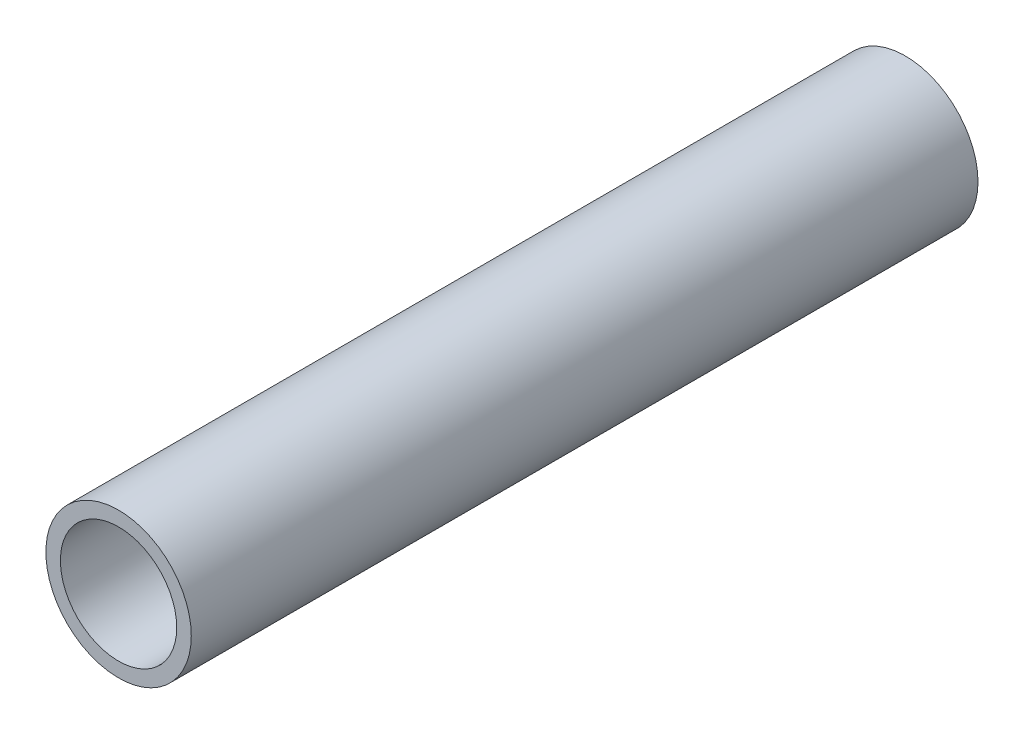
ISO-10303-21;
HEADER;
FILE_DESCRIPTION(('STEP AP214'),'2;1');
FILE_NAME('part.step','',(''),(''),'','','');
FILE_SCHEMA(('AUTOMOTIVE_DESIGN { 1 0 10303 214 1 1 1 1 }'));
ENDSEC;
DATA;
#1=APPLICATION_CONTEXT('core data for automotive mechanical design processes');
#2=APPLICATION_PROTOCOL_DEFINITION('international standard','automotive_design',2000,#1);
#3=PRODUCT_CONTEXT('',#1,'mechanical');
#4=PRODUCT('Part','Part','',(#3));
#5=PRODUCT_RELATED_PRODUCT_CATEGORY('part','',(#4));
#6=PRODUCT_DEFINITION_FORMATION('','',#4);
#7=PRODUCT_DEFINITION_CONTEXT('part definition',#1,'design');
#8=PRODUCT_DEFINITION('design','',#6,#7);
#9=PRODUCT_DEFINITION_SHAPE('','',#8);
#10=(LENGTH_UNIT() NAMED_UNIT(*) SI_UNIT(.MILLI.,.METRE.));
#11=(NAMED_UNIT(*) PLANE_ANGLE_UNIT() SI_UNIT($,.RADIAN.));
#12=(NAMED_UNIT(*) SI_UNIT($,.STERADIAN.) SOLID_ANGLE_UNIT());
#13=UNCERTAINTY_MEASURE_WITH_UNIT(LENGTH_MEASURE(1.E-05),#10,'distance_accuracy_value','');
#14=(GEOMETRIC_REPRESENTATION_CONTEXT(3) GLOBAL_UNCERTAINTY_ASSIGNED_CONTEXT((#13)) GLOBAL_UNIT_ASSIGNED_CONTEXT((#10,
#11,#12)) REPRESENTATION_CONTEXT('',''));
#15=CARTESIAN_POINT('',(0.,0.,0.));
#16=DIRECTION('',(0.,0.,1.));
#17=DIRECTION('',(1.,0.,0.));
#18=AXIS2_PLACEMENT_3D('',#15,#16,#17);
#19=CARTESIAN_POINT('',(0.,0.,13.525));
#20=DIRECTION('',(0.,0.,1.));
#21=DIRECTION('',(1.,0.,0.));
#22=AXIS2_PLACEMENT_3D('',#19,#20,#21);
#23=PLANE('',#22);
#24=CARTESIAN_POINT('',(0.,0.,13.525));
#25=DIRECTION('',(0.,0.,1.));
#26=DIRECTION('',(1.,0.,0.));
#27=AXIS2_PLACEMENT_3D('',#24,#25,#26);
#28=CIRCLE('',#27,1.25);
#29=CARTESIAN_POINT('',(1.25,0.,13.525));
#30=VERTEX_POINT('',#29);
#31=EDGE_CURVE('E10',#30,#30,#28,.T.);
#32=ORIENTED_EDGE('',*,*,#31,.T.);
#33=EDGE_LOOP('',(#32));
#34=FACE_BOUND('',#33,.T.);
#35=CARTESIAN_POINT('',(0.,0.,13.525));
#36=DIRECTION('',(0.,0.,1.));
#37=DIRECTION('',(1.,0.,0.));
#38=AXIS2_PLACEMENT_3D('',#35,#36,#37);
#39=CIRCLE('',#38,1.);
#40=CARTESIAN_POINT('',(1.,0.,13.525));
#41=VERTEX_POINT('',#40);
#42=EDGE_CURVE('E41',#41,#41,#39,.T.);
#43=ORIENTED_EDGE('',*,*,#42,.F.);
#44=EDGE_LOOP('',(#43));
#45=FACE_BOUND('',#44,.T.);
#46=ADVANCED_FACE('F30',(#34,#45),#23,.T.);
#47=CARTESIAN_POINT('',(0.,0.,0.));
#48=DIRECTION('',(0.,0.,1.));
#49=DIRECTION('',(1.,0.,0.));
#50=AXIS2_PLACEMENT_3D('',#47,#48,#49);
#51=PLANE('',#50);
#52=CARTESIAN_POINT('',(0.,0.,0.));
#53=DIRECTION('',(0.,0.,1.));
#54=DIRECTION('',(1.,0.,0.));
#55=AXIS2_PLACEMENT_3D('',#52,#53,#54);
#56=CIRCLE('',#55,1.25);
#57=CARTESIAN_POINT('',(1.25,0.,0.));
#58=VERTEX_POINT('',#57);
#59=EDGE_CURVE('E34',#58,#58,#56,.T.);
#60=ORIENTED_EDGE('',*,*,#59,.F.);
#61=EDGE_LOOP('',(#60));
#62=FACE_BOUND('',#61,.T.);
#63=CARTESIAN_POINT('',(0.,0.,0.));
#64=DIRECTION('',(0.,0.,1.));
#65=DIRECTION('',(1.,0.,0.));
#66=AXIS2_PLACEMENT_3D('',#63,#64,#65);
#67=CIRCLE('',#66,1.);
#68=CARTESIAN_POINT('',(1.,0.,0.));
#69=VERTEX_POINT('',#68);
#70=EDGE_CURVE('E43',#69,#69,#67,.T.);
#71=ORIENTED_EDGE('',*,*,#70,.T.);
#72=EDGE_LOOP('',(#71));
#73=FACE_BOUND('',#72,.T.);
#74=ADVANCED_FACE('F53',(#62,#73),#51,.F.);
#75=CARTESIAN_POINT('',(0.,0.,13.525));
#76=DIRECTION('',(0.,0.,-1.));
#77=DIRECTION('',(-1.,0.,0.));
#78=AXIS2_PLACEMENT_3D('',#75,#76,#77);
#79=CYLINDRICAL_SURFACE('',#78,1.25);
#80=ORIENTED_EDGE('',*,*,#31,.F.);
#81=EDGE_LOOP('',(#80));
#82=FACE_BOUND('',#81,.T.);
#83=ORIENTED_EDGE('',*,*,#59,.T.);
#84=EDGE_LOOP('',(#83));
#85=FACE_BOUND('',#84,.T.);
#86=ADVANCED_FACE('F32',(#82,#85),#79,.T.);
#87=CARTESIAN_POINT('',(0.,0.,13.525));
#88=DIRECTION('',(0.,0.,-1.));
#89=DIRECTION('',(-1.,0.,0.));
#90=AXIS2_PLACEMENT_3D('',#87,#88,#89);
#91=CYLINDRICAL_SURFACE('',#90,1.);
#92=ORIENTED_EDGE('',*,*,#42,.T.);
#93=EDGE_LOOP('',(#92));
#94=FACE_BOUND('',#93,.T.);
#95=ORIENTED_EDGE('',*,*,#70,.F.);
#96=EDGE_LOOP('',(#95));
#97=FACE_BOUND('',#96,.T.);
#98=ADVANCED_FACE('F49',(#94,#97),#91,.F.);
#99=CLOSED_SHELL('',(#46,#74,#86,#98));
#100=MANIFOLD_SOLID_BREP('B2',#99);
#101=ADVANCED_BREP_SHAPE_REPRESENTATION('',(#18,#100),#14);
#102=SHAPE_DEFINITION_REPRESENTATION(#9,#101);
ENDSEC;
END-ISO-10303-21;
